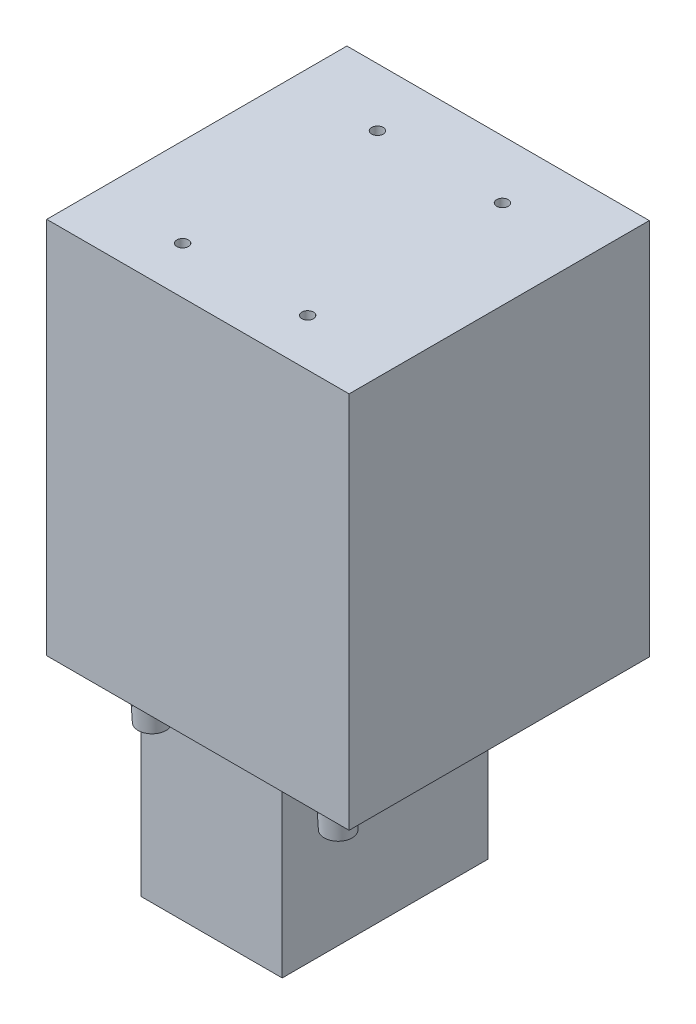
ISO-10303-21;
HEADER;
FILE_DESCRIPTION(('STEP AP214'),'2;1');
FILE_NAME('part.step','',(''),(''),'','','');
FILE_SCHEMA(('AUTOMOTIVE_DESIGN { 1 0 10303 214 1 1 1 1 }'));
ENDSEC;
DATA;
#1=APPLICATION_CONTEXT('core data for automotive mechanical design processes');
#2=APPLICATION_PROTOCOL_DEFINITION('international standard','automotive_design',2000,#1);
#3=PRODUCT_CONTEXT('',#1,'mechanical');
#4=PRODUCT('Part','Part','',(#3));
#5=PRODUCT_RELATED_PRODUCT_CATEGORY('part','',(#4));
#6=PRODUCT_DEFINITION_FORMATION('','',#4);
#7=PRODUCT_DEFINITION_CONTEXT('part definition',#1,'design');
#8=PRODUCT_DEFINITION('design','',#6,#7);
#9=PRODUCT_DEFINITION_SHAPE('','',#8);
#10=(LENGTH_UNIT() NAMED_UNIT(*) SI_UNIT(.MILLI.,.METRE.));
#11=(NAMED_UNIT(*) PLANE_ANGLE_UNIT() SI_UNIT($,.RADIAN.));
#12=(NAMED_UNIT(*) SI_UNIT($,.STERADIAN.) SOLID_ANGLE_UNIT());
#13=UNCERTAINTY_MEASURE_WITH_UNIT(LENGTH_MEASURE(1.E-05),#10,'distance_accuracy_value','');
#14=(GEOMETRIC_REPRESENTATION_CONTEXT(3) GLOBAL_UNCERTAINTY_ASSIGNED_CONTEXT((#13)) GLOBAL_UNIT_ASSIGNED_CONTEXT((#10,
#11,#12)) REPRESENTATION_CONTEXT('',''));
#15=CARTESIAN_POINT('',(0.,0.,0.));
#16=DIRECTION('',(0.,0.,1.));
#17=DIRECTION('',(1.,0.,0.));
#18=AXIS2_PLACEMENT_3D('',#15,#16,#17);
#19=CARTESIAN_POINT('',(11.5,65.,0.));
#20=DIRECTION('',(1.,0.,0.));
#21=DIRECTION('',(0.,0.,-1.));
#22=AXIS2_PLACEMENT_3D('',#19,#20,#21);
#23=PLANE('',#22);
#24=DIRECTION('',(0.,0.,1.));
#25=VECTOR('',#24,1.);
#26=CARTESIAN_POINT('',(11.5,0.,0.));
#27=LINE('',#26,#25);
#28=CARTESIAN_POINT('',(11.5,0.,-35.375));
#29=VERTEX_POINT('',#28);
#30=CARTESIAN_POINT('',(11.5,0.,16.25));
#31=VERTEX_POINT('',#30);
#32=EDGE_CURVE('E184',#29,#31,#27,.T.);
#33=ORIENTED_EDGE('',*,*,#32,.F.);
#34=DIRECTION('',(0.,-1.,0.));
#35=VECTOR('',#34,1.);
#36=CARTESIAN_POINT('',(11.5,65.,-35.375));
#37=LINE('',#36,#35);
#38=CARTESIAN_POINT('',(11.5,65.,-35.375));
#39=VERTEX_POINT('',#38);
#40=EDGE_CURVE('E11',#39,#29,#37,.T.);
#41=ORIENTED_EDGE('',*,*,#40,.F.);
#42=DIRECTION('',(0.,0.,1.));
#43=VECTOR('',#42,1.);
#44=CARTESIAN_POINT('',(11.5,65.,0.));
#45=LINE('',#44,#43);
#46=CARTESIAN_POINT('',(11.5,65.,16.25));
#47=VERTEX_POINT('',#46);
#48=EDGE_CURVE('E188',#39,#47,#45,.T.);
#49=ORIENTED_EDGE('',*,*,#48,.T.);
#50=DIRECTION('',(0.,-1.,0.));
#51=VECTOR('',#50,1.);
#52=CARTESIAN_POINT('',(11.5,65.,16.25));
#53=LINE('',#52,#51);
#54=EDGE_CURVE('E82',#47,#31,#53,.T.);
#55=ORIENTED_EDGE('',*,*,#54,.T.);
#56=EDGE_LOOP('',(#33,#41,#49,#55));
#57=FACE_BOUND('',#56,.T.);
#58=ADVANCED_FACE('F39',(#57),#23,.T.);
#59=CARTESIAN_POINT('',(0.,65.,-35.375));
#60=DIRECTION('',(0.,0.,-1.));
#61=DIRECTION('',(-1.,0.,0.));
#62=AXIS2_PLACEMENT_3D('',#59,#60,#61);
#63=PLANE('',#62);
#64=DIRECTION('',(1.,0.,0.));
#65=VECTOR('',#64,1.);
#66=CARTESIAN_POINT('',(0.,0.,-35.375));
#67=LINE('',#66,#65);
#68=CARTESIAN_POINT('',(-16.25,0.,-35.375));
#69=VERTEX_POINT('',#68);
#70=EDGE_CURVE('E202',#69,#29,#67,.T.);
#71=ORIENTED_EDGE('',*,*,#70,.F.);
#72=DIRECTION('',(0.,1.,0.));
#73=VECTOR('',#72,1.);
#74=CARTESIAN_POINT('',(-16.25,-44.,-35.375));
#75=LINE('',#74,#73);
#76=CARTESIAN_POINT('',(-16.25,-44.,-35.375));
#77=VERTEX_POINT('',#76);
#78=EDGE_CURVE('E54',#77,#69,#75,.T.);
#79=ORIENTED_EDGE('',*,*,#78,.F.);
#80=DIRECTION('',(1.,0.,0.));
#81=VECTOR('',#80,1.);
#82=CARTESIAN_POINT('',(0.,-44.,-35.375));
#83=LINE('',#82,#81);
#84=CARTESIAN_POINT('',(-40.5,-44.,-35.375));
#85=VERTEX_POINT('',#84);
#86=EDGE_CURVE('E122',#85,#77,#83,.T.);
#87=ORIENTED_EDGE('',*,*,#86,.F.);
#88=DIRECTION('',(0.,-1.,0.));
#89=VECTOR('',#88,1.);
#90=CARTESIAN_POINT('',(-40.5,65.,-35.375));
#91=LINE('',#90,#89);
#92=CARTESIAN_POINT('',(-40.5,65.,-35.375));
#93=VERTEX_POINT('',#92);
#94=EDGE_CURVE('E47',#93,#85,#91,.T.);
#95=ORIENTED_EDGE('',*,*,#94,.F.);
#96=DIRECTION('',(1.,0.,0.));
#97=VECTOR('',#96,1.);
#98=CARTESIAN_POINT('',(0.,65.,-35.375));
#99=LINE('',#98,#97);
#100=EDGE_CURVE('E191',#93,#39,#99,.T.);
#101=ORIENTED_EDGE('',*,*,#100,.T.);
#102=ORIENTED_EDGE('',*,*,#40,.T.);
#103=EDGE_LOOP('',(#71,#79,#87,#95,#101,#102));
#104=FACE_BOUND('',#103,.T.);
#105=ADVANCED_FACE('F128',(#104),#63,.T.);
#106=CARTESIAN_POINT('',(-40.5,65.,0.));
#107=DIRECTION('',(-1.,0.,0.));
#108=DIRECTION('',(0.,0.,1.));
#109=AXIS2_PLACEMENT_3D('',#106,#107,#108);
#110=PLANE('',#109);
#111=DIRECTION('',(0.,0.,-1.));
#112=VECTOR('',#111,1.);
#113=CARTESIAN_POINT('',(-40.5,0.,0.));
#114=LINE('',#113,#112);
#115=CARTESIAN_POINT('',(-40.5,0.,16.25));
#116=VERTEX_POINT('',#115);
#117=CARTESIAN_POINT('',(-40.5,0.,0.));
#118=VERTEX_POINT('',#117);
#119=EDGE_CURVE('E205',#116,#118,#114,.T.);
#120=ORIENTED_EDGE('',*,*,#119,.F.);
#121=DIRECTION('',(0.,-1.,0.));
#122=VECTOR('',#121,1.);
#123=CARTESIAN_POINT('',(-40.5,65.,16.25));
#124=LINE('',#123,#122);
#125=CARTESIAN_POINT('',(-40.5,65.,16.25));
#126=VERTEX_POINT('',#125);
#127=EDGE_CURVE('E118',#126,#116,#124,.T.);
#128=ORIENTED_EDGE('',*,*,#127,.F.);
#129=DIRECTION('',(0.,0.,-1.));
#130=VECTOR('',#129,1.);
#131=CARTESIAN_POINT('',(-40.5,65.,0.));
#132=LINE('',#131,#130);
#133=EDGE_CURVE('E112',#126,#93,#132,.T.);
#134=ORIENTED_EDGE('',*,*,#133,.T.);
#135=ORIENTED_EDGE('',*,*,#94,.T.);
#136=DIRECTION('',(0.,0.,-1.));
#137=VECTOR('',#136,1.);
#138=CARTESIAN_POINT('',(-40.5,-44.,0.));
#139=LINE('',#138,#137);
#140=CARTESIAN_POINT('',(-40.5,-44.,0.));
#141=VERTEX_POINT('',#140);
#142=EDGE_CURVE('E110',#141,#85,#139,.T.);
#143=ORIENTED_EDGE('',*,*,#142,.F.);
#144=DIRECTION('',(0.,1.,0.));
#145=VECTOR('',#144,1.);
#146=CARTESIAN_POINT('',(-40.5,-44.,0.));
#147=LINE('',#146,#145);
#148=EDGE_CURVE('E144',#141,#118,#147,.T.);
#149=ORIENTED_EDGE('',*,*,#148,.T.);
#150=EDGE_LOOP('',(#120,#128,#134,#135,#143,#149));
#151=FACE_BOUND('',#150,.T.);
#152=ADVANCED_FACE('F109',(#151),#110,.T.);
#153=CARTESIAN_POINT('',(0.,65.,16.25));
#154=DIRECTION('',(0.,0.,-1.));
#155=DIRECTION('',(-1.,0.,0.));
#156=AXIS2_PLACEMENT_3D('',#153,#154,#155);
#157=PLANE('',#156);
#158=DIRECTION('',(1.,0.,0.));
#159=VECTOR('',#158,1.);
#160=CARTESIAN_POINT('',(0.,0.,16.25));
#161=LINE('',#160,#159);
#162=EDGE_CURVE('E192',#116,#31,#161,.T.);
#163=ORIENTED_EDGE('',*,*,#162,.T.);
#164=ORIENTED_EDGE('',*,*,#54,.F.);
#165=DIRECTION('',(1.,0.,0.));
#166=VECTOR('',#165,1.);
#167=CARTESIAN_POINT('',(0.,65.,16.25));
#168=LINE('',#167,#166);
#169=EDGE_CURVE('E63',#126,#47,#168,.T.);
#170=ORIENTED_EDGE('',*,*,#169,.F.);
#171=ORIENTED_EDGE('',*,*,#127,.T.);
#172=EDGE_LOOP('',(#163,#164,#170,#171));
#173=FACE_BOUND('',#172,.T.);
#174=ADVANCED_FACE('F216',(#173),#157,.F.);
#175=CARTESIAN_POINT('',(0.,65.,0.));
#176=DIRECTION('',(0.,1.,0.));
#177=DIRECTION('',(0.,0.,1.));
#178=AXIS2_PLACEMENT_3D('',#175,#176,#177);
#179=PLANE('',#178);
#180=CARTESIAN_POINT('',(-25.25,65.,8.12500000000001));
#181=DIRECTION('',(0.,1.,0.));
#182=DIRECTION('',(0.,0.,1.));
#183=AXIS2_PLACEMENT_3D('',#180,#181,#182);
#184=CIRCLE('',#183,0.999999999999998);
#185=CARTESIAN_POINT('',(-25.25,65.,9.12500000000001));
#186=VERTEX_POINT('',#185);
#187=EDGE_CURVE('E169',#186,#186,#184,.T.);
#188=ORIENTED_EDGE('',*,*,#187,.F.);
#189=EDGE_LOOP('',(#188));
#190=FACE_BOUND('',#189,.T.);
#191=CARTESIAN_POINT('',(-3.75,65.,-25.375));
#192=DIRECTION('',(0.,1.,0.));
#193=DIRECTION('',(0.,0.,1.));
#194=AXIS2_PLACEMENT_3D('',#191,#192,#193);
#195=CIRCLE('',#194,1.);
#196=CARTESIAN_POINT('',(-3.75,65.,-24.375));
#197=VERTEX_POINT('',#196);
#198=EDGE_CURVE('E160',#197,#197,#195,.T.);
#199=ORIENTED_EDGE('',*,*,#198,.F.);
#200=EDGE_LOOP('',(#199));
#201=FACE_BOUND('',#200,.T.);
#202=CARTESIAN_POINT('',(-25.25,65.,-25.375));
#203=DIRECTION('',(0.,1.,0.));
#204=DIRECTION('',(0.,0.,1.));
#205=AXIS2_PLACEMENT_3D('',#202,#203,#204);
#206=CIRCLE('',#205,0.999999999999998);
#207=CARTESIAN_POINT('',(-25.25,65.,-24.375));
#208=VERTEX_POINT('',#207);
#209=EDGE_CURVE('E150',#208,#208,#206,.T.);
#210=ORIENTED_EDGE('',*,*,#209,.F.);
#211=EDGE_LOOP('',(#210));
#212=FACE_BOUND('',#211,.T.);
#213=CARTESIAN_POINT('',(-3.74999999999999,65.,8.12500000000001));
#214=DIRECTION('',(0.,1.,0.));
#215=DIRECTION('',(0.,0.,1.));
#216=AXIS2_PLACEMENT_3D('',#213,#214,#215);
#217=CIRCLE('',#216,0.999999999999998);
#218=CARTESIAN_POINT('',(-3.74999999999999,65.,9.12500000000001));
#219=VERTEX_POINT('',#218);
#220=EDGE_CURVE('E168',#219,#219,#217,.T.);
#221=ORIENTED_EDGE('',*,*,#220,.F.);
#222=EDGE_LOOP('',(#221));
#223=FACE_BOUND('',#222,.T.);
#224=ORIENTED_EDGE('',*,*,#48,.F.);
#225=ORIENTED_EDGE('',*,*,#100,.F.);
#226=ORIENTED_EDGE('',*,*,#133,.F.);
#227=ORIENTED_EDGE('',*,*,#169,.T.);
#228=EDGE_LOOP('',(#224,#225,#226,#227));
#229=FACE_BOUND('',#228,.T.);
#230=ADVANCED_FACE('F233',(#190,#201,#212,#223,#229),#179,.T.);
#231=CARTESIAN_POINT('',(0.,0.,0.));
#232=DIRECTION('',(0.,1.,0.));
#233=DIRECTION('',(0.,0.,1.));
#234=AXIS2_PLACEMENT_3D('',#231,#232,#233);
#235=PLANE('',#234);
#236=CARTESIAN_POINT('',(-30.5,0.,8.125));
#237=DIRECTION('',(0.,1.,0.));
#238=DIRECTION('',(0.,0.,1.));
#239=AXIS2_PLACEMENT_3D('',#236,#237,#238);
#240=CIRCLE('',#239,2.875);
#241=CARTESIAN_POINT('',(-30.5,0.,11.));
#242=VERTEX_POINT('',#241);
#243=EDGE_CURVE('E301',#242,#242,#240,.T.);
#244=ORIENTED_EDGE('',*,*,#243,.T.);
#245=EDGE_LOOP('',(#244));
#246=FACE_BOUND('',#245,.T.);
#247=CARTESIAN_POINT('',(1.5,0.,8.125));
#248=DIRECTION('',(0.,1.,0.));
#249=DIRECTION('',(0.,0.,1.));
#250=AXIS2_PLACEMENT_3D('',#247,#248,#249);
#251=CIRCLE('',#250,2.875);
#252=CARTESIAN_POINT('',(1.5,0.,11.));
#253=VERTEX_POINT('',#252);
#254=EDGE_CURVE('E300',#253,#253,#251,.T.);
#255=ORIENTED_EDGE('',*,*,#254,.T.);
#256=EDGE_LOOP('',(#255));
#257=FACE_BOUND('',#256,.T.);
#258=ORIENTED_EDGE('',*,*,#119,.T.);
#259=DIRECTION('',(1.,0.,0.));
#260=VECTOR('',#259,1.);
#261=CARTESIAN_POINT('',(0.,0.,0.));
#262=LINE('',#261,#260);
#263=CARTESIAN_POINT('',(-16.25,0.,0.));
#264=VERTEX_POINT('',#263);
#265=EDGE_CURVE('E133',#118,#264,#262,.T.);
#266=ORIENTED_EDGE('',*,*,#265,.T.);
#267=DIRECTION('',(0.,0.,-1.));
#268=VECTOR('',#267,1.);
#269=CARTESIAN_POINT('',(-16.25,0.,0.));
#270=LINE('',#269,#268);
#271=EDGE_CURVE('E130',#264,#69,#270,.T.);
#272=ORIENTED_EDGE('',*,*,#271,.T.);
#273=ORIENTED_EDGE('',*,*,#70,.T.);
#274=ORIENTED_EDGE('',*,*,#32,.T.);
#275=ORIENTED_EDGE('',*,*,#162,.F.);
#276=EDGE_LOOP('',(#258,#266,#272,#273,#274,#275));
#277=FACE_BOUND('',#276,.T.);
#278=ADVANCED_FACE('F218',(#246,#257,#277),#235,.F.);
#279=CARTESIAN_POINT('',(-3.74999999999999,50.,8.12500000000001));
#280=DIRECTION('',(0.,1.,0.));
#281=DIRECTION('',(0.,0.,1.));
#282=AXIS2_PLACEMENT_3D('',#279,#280,#281);
#283=CYLINDRICAL_SURFACE('',#282,0.999999999999998);
#284=CARTESIAN_POINT('',(-3.74999999999999,50.,8.12500000000001));
#285=DIRECTION('',(0.,1.,0.));
#286=DIRECTION('',(0.,0.,1.));
#287=AXIS2_PLACEMENT_3D('',#284,#285,#286);
#288=CIRCLE('',#287,0.999999999999998);
#289=CARTESIAN_POINT('',(-3.74999999999999,50.,9.12500000000001));
#290=VERTEX_POINT('',#289);
#291=EDGE_CURVE('E180',#290,#290,#288,.T.);
#292=ORIENTED_EDGE('',*,*,#291,.F.);
#293=EDGE_LOOP('',(#292));
#294=FACE_BOUND('',#293,.T.);
#295=ORIENTED_EDGE('',*,*,#220,.T.);
#296=EDGE_LOOP('',(#295));
#297=FACE_BOUND('',#296,.T.);
#298=ADVANCED_FACE('F236',(#294,#297),#283,.F.);
#299=CARTESIAN_POINT('',(-3.74999999999999,50.,8.12500000000001));
#300=DIRECTION('',(0.,1.,0.));
#301=DIRECTION('',(0.,0.,1.));
#302=AXIS2_PLACEMENT_3D('',#299,#300,#301);
#303=PLANE('',#302);
#304=ORIENTED_EDGE('',*,*,#291,.T.);
#305=EDGE_LOOP('',(#304));
#306=FACE_BOUND('',#305,.T.);
#307=ADVANCED_FACE('F243',(#306),#303,.T.);
#308=CARTESIAN_POINT('',(-25.25,50.,-25.375));
#309=DIRECTION('',(0.,1.,0.));
#310=DIRECTION('',(0.,0.,1.));
#311=AXIS2_PLACEMENT_3D('',#308,#309,#310);
#312=CYLINDRICAL_SURFACE('',#311,0.999999999999998);
#313=CARTESIAN_POINT('',(-25.25,50.,-25.375));
#314=DIRECTION('',(0.,1.,0.));
#315=DIRECTION('',(0.,0.,1.));
#316=AXIS2_PLACEMENT_3D('',#313,#314,#315);
#317=CIRCLE('',#316,0.999999999999998);
#318=CARTESIAN_POINT('',(-25.25,50.,-24.375));
#319=VERTEX_POINT('',#318);
#320=EDGE_CURVE('E156',#319,#319,#317,.T.);
#321=ORIENTED_EDGE('',*,*,#320,.F.);
#322=EDGE_LOOP('',(#321));
#323=FACE_BOUND('',#322,.T.);
#324=ORIENTED_EDGE('',*,*,#209,.T.);
#325=EDGE_LOOP('',(#324));
#326=FACE_BOUND('',#325,.T.);
#327=ADVANCED_FACE('F247',(#323,#326),#312,.F.);
#328=CARTESIAN_POINT('',(-25.25,50.,-25.375));
#329=DIRECTION('',(0.,1.,0.));
#330=DIRECTION('',(0.,0.,1.));
#331=AXIS2_PLACEMENT_3D('',#328,#329,#330);
#332=PLANE('',#331);
#333=ORIENTED_EDGE('',*,*,#320,.T.);
#334=EDGE_LOOP('',(#333));
#335=FACE_BOUND('',#334,.T.);
#336=ADVANCED_FACE('F253',(#335),#332,.T.);
#337=CARTESIAN_POINT('',(-3.75,50.,-25.375));
#338=DIRECTION('',(0.,1.,0.));
#339=DIRECTION('',(0.,0.,1.));
#340=AXIS2_PLACEMENT_3D('',#337,#338,#339);
#341=CYLINDRICAL_SURFACE('',#340,1.);
#342=CARTESIAN_POINT('',(-3.75,50.,-25.375));
#343=DIRECTION('',(0.,1.,0.));
#344=DIRECTION('',(0.,0.,1.));
#345=AXIS2_PLACEMENT_3D('',#342,#343,#344);
#346=CIRCLE('',#345,1.);
#347=CARTESIAN_POINT('',(-3.75,50.,-24.375));
#348=VERTEX_POINT('',#347);
#349=EDGE_CURVE('E173',#348,#348,#346,.T.);
#350=ORIENTED_EDGE('',*,*,#349,.F.);
#351=EDGE_LOOP('',(#350));
#352=FACE_BOUND('',#351,.T.);
#353=ORIENTED_EDGE('',*,*,#198,.T.);
#354=EDGE_LOOP('',(#353));
#355=FACE_BOUND('',#354,.T.);
#356=ADVANCED_FACE('F249',(#352,#355),#341,.F.);
#357=CARTESIAN_POINT('',(-3.75,50.,-25.375));
#358=DIRECTION('',(0.,1.,0.));
#359=DIRECTION('',(0.,0.,1.));
#360=AXIS2_PLACEMENT_3D('',#357,#358,#359);
#361=PLANE('',#360);
#362=ORIENTED_EDGE('',*,*,#349,.T.);
#363=EDGE_LOOP('',(#362));
#364=FACE_BOUND('',#363,.T.);
#365=ADVANCED_FACE('F252',(#364),#361,.T.);
#366=CARTESIAN_POINT('',(-25.25,50.,8.12500000000001));
#367=DIRECTION('',(0.,1.,0.));
#368=DIRECTION('',(0.,0.,1.));
#369=AXIS2_PLACEMENT_3D('',#366,#367,#368);
#370=CYLINDRICAL_SURFACE('',#369,0.999999999999998);
#371=CARTESIAN_POINT('',(-25.25,50.,8.12500000000001));
#372=DIRECTION('',(0.,1.,0.));
#373=DIRECTION('',(0.,0.,1.));
#374=AXIS2_PLACEMENT_3D('',#371,#372,#373);
#375=CIRCLE('',#374,0.999999999999998);
#376=CARTESIAN_POINT('',(-25.25,50.,9.12500000000001));
#377=VERTEX_POINT('',#376);
#378=EDGE_CURVE('E164',#377,#377,#375,.T.);
#379=ORIENTED_EDGE('',*,*,#378,.F.);
#380=EDGE_LOOP('',(#379));
#381=FACE_BOUND('',#380,.T.);
#382=ORIENTED_EDGE('',*,*,#187,.T.);
#383=EDGE_LOOP('',(#382));
#384=FACE_BOUND('',#383,.T.);
#385=ADVANCED_FACE('F257',(#381,#384),#370,.F.);
#386=CARTESIAN_POINT('',(-25.25,50.,8.12500000000001));
#387=DIRECTION('',(0.,1.,0.));
#388=DIRECTION('',(0.,0.,1.));
#389=AXIS2_PLACEMENT_3D('',#386,#387,#388);
#390=PLANE('',#389);
#391=ORIENTED_EDGE('',*,*,#378,.T.);
#392=EDGE_LOOP('',(#391));
#393=FACE_BOUND('',#392,.T.);
#394=ADVANCED_FACE('F261',(#393),#390,.T.);
#395=CARTESIAN_POINT('',(-16.25,-44.,0.));
#396=DIRECTION('',(1.,0.,0.));
#397=DIRECTION('',(0.,0.,-1.));
#398=AXIS2_PLACEMENT_3D('',#395,#396,#397);
#399=PLANE('',#398);
#400=ORIENTED_EDGE('',*,*,#271,.F.);
#401=DIRECTION('',(0.,1.,0.));
#402=VECTOR('',#401,1.);
#403=CARTESIAN_POINT('',(-16.25,-44.,0.));
#404=LINE('',#403,#402);
#405=CARTESIAN_POINT('',(-16.25,-44.,0.));
#406=VERTEX_POINT('',#405);
#407=EDGE_CURVE('E151',#406,#264,#404,.T.);
#408=ORIENTED_EDGE('',*,*,#407,.F.);
#409=DIRECTION('',(0.,0.,-1.));
#410=VECTOR('',#409,1.);
#411=CARTESIAN_POINT('',(-16.25,-44.,0.));
#412=LINE('',#411,#410);
#413=EDGE_CURVE('E141',#406,#77,#412,.T.);
#414=ORIENTED_EDGE('',*,*,#413,.T.);
#415=ORIENTED_EDGE('',*,*,#78,.T.);
#416=EDGE_LOOP('',(#400,#408,#414,#415));
#417=FACE_BOUND('',#416,.T.);
#418=ADVANCED_FACE('F265',(#417),#399,.T.);
#419=CARTESIAN_POINT('',(0.,-44.,0.));
#420=DIRECTION('',(0.,0.,1.));
#421=DIRECTION('',(1.,0.,0.));
#422=AXIS2_PLACEMENT_3D('',#419,#420,#421);
#423=PLANE('',#422);
#424=ORIENTED_EDGE('',*,*,#265,.F.);
#425=ORIENTED_EDGE('',*,*,#148,.F.);
#426=DIRECTION('',(1.,0.,0.));
#427=VECTOR('',#426,1.);
#428=CARTESIAN_POINT('',(0.,-44.,0.));
#429=LINE('',#428,#427);
#430=EDGE_CURVE('E124',#141,#406,#429,.T.);
#431=ORIENTED_EDGE('',*,*,#430,.T.);
#432=ORIENTED_EDGE('',*,*,#407,.T.);
#433=EDGE_LOOP('',(#424,#425,#431,#432));
#434=FACE_BOUND('',#433,.T.);
#435=ADVANCED_FACE('F221',(#434),#423,.T.);
#436=CARTESIAN_POINT('',(0.,-44.,0.));
#437=DIRECTION('',(0.,1.,0.));
#438=DIRECTION('',(0.,0.,1.));
#439=AXIS2_PLACEMENT_3D('',#436,#437,#438);
#440=PLANE('',#439);
#441=ORIENTED_EDGE('',*,*,#86,.T.);
#442=ORIENTED_EDGE('',*,*,#413,.F.);
#443=ORIENTED_EDGE('',*,*,#430,.F.);
#444=ORIENTED_EDGE('',*,*,#142,.T.);
#445=EDGE_LOOP('',(#441,#442,#443,#444));
#446=FACE_BOUND('',#445,.T.);
#447=ADVANCED_FACE('F120',(#446),#440,.F.);
#448=CARTESIAN_POINT('',(1.5,0.,8.125));
#449=DIRECTION('',(0.,1.,0.));
#450=DIRECTION('',(0.,0.,1.));
#451=AXIS2_PLACEMENT_3D('',#448,#449,#450);
#452=CONICAL_SURFACE('',#451,2.875,0.05235987755983);
#453=CARTESIAN_POINT('',(1.5,-9.,8.125));
#454=DIRECTION('',(0.,1.,0.));
#455=DIRECTION('',(0.,0.,1.));
#456=AXIS2_PLACEMENT_3D('',#453,#454,#455);
#457=CIRCLE('',#456,2.40332998645263);
#458=CARTESIAN_POINT('',(1.5,-9.,10.5283299864526));
#459=VERTEX_POINT('',#458);
#460=EDGE_CURVE('E136',#459,#459,#457,.T.);
#461=ORIENTED_EDGE('',*,*,#460,.T.);
#462=EDGE_LOOP('',(#461));
#463=FACE_BOUND('',#462,.T.);
#464=ORIENTED_EDGE('',*,*,#254,.F.);
#465=EDGE_LOOP('',(#464));
#466=FACE_BOUND('',#465,.T.);
#467=ADVANCED_FACE('F279',(#463,#466),#452,.T.);
#468=CARTESIAN_POINT('',(0.,-9.,0.));
#469=DIRECTION('',(0.,1.,0.));
#470=DIRECTION('',(0.,0.,1.));
#471=AXIS2_PLACEMENT_3D('',#468,#469,#470);
#472=PLANE('',#471);
#473=ORIENTED_EDGE('',*,*,#460,.F.);
#474=EDGE_LOOP('',(#473));
#475=FACE_BOUND('',#474,.T.);
#476=ADVANCED_FACE('F282',(#475),#472,.F.);
#477=CARTESIAN_POINT('',(-30.5,0.,8.125));
#478=DIRECTION('',(0.,1.,0.));
#479=DIRECTION('',(0.,0.,1.));
#480=AXIS2_PLACEMENT_3D('',#477,#478,#479);
#481=CONICAL_SURFACE('',#480,2.875,0.05235987755983);
#482=CARTESIAN_POINT('',(-30.5,-9.,8.125));
#483=DIRECTION('',(0.,1.,0.));
#484=DIRECTION('',(0.,0.,1.));
#485=AXIS2_PLACEMENT_3D('',#482,#483,#484);
#486=CIRCLE('',#485,2.40332998645263);
#487=CARTESIAN_POINT('',(-30.5,-9.,10.5283299864526));
#488=VERTEX_POINT('',#487);
#489=EDGE_CURVE('E298',#488,#488,#486,.T.);
#490=ORIENTED_EDGE('',*,*,#489,.T.);
#491=EDGE_LOOP('',(#490));
#492=FACE_BOUND('',#491,.T.);
#493=ORIENTED_EDGE('',*,*,#243,.F.);
#494=EDGE_LOOP('',(#493));
#495=FACE_BOUND('',#494,.T.);
#496=ADVANCED_FACE('F286',(#492,#495),#481,.T.);
#497=CARTESIAN_POINT('',(0.,-9.,0.));
#498=DIRECTION('',(0.,1.,0.));
#499=DIRECTION('',(0.,0.,1.));
#500=AXIS2_PLACEMENT_3D('',#497,#498,#499);
#501=PLANE('',#500);
#502=ORIENTED_EDGE('',*,*,#489,.F.);
#503=EDGE_LOOP('',(#502));
#504=FACE_BOUND('',#503,.T.);
#505=ADVANCED_FACE('F290',(#504),#501,.F.);
#506=CLOSED_SHELL('',(#58,#105,#152,#174,#230,#278,#298,#307,#327,#336,#356,#365,#385,#394,#418,
#435,#447,#467,#476,#496,#505));
#507=MANIFOLD_SOLID_BREP('B2',#506);
#508=ADVANCED_BREP_SHAPE_REPRESENTATION('',(#18,#507),#14);
#509=SHAPE_DEFINITION_REPRESENTATION(#9,#508);
ENDSEC;
END-ISO-10303-21;
